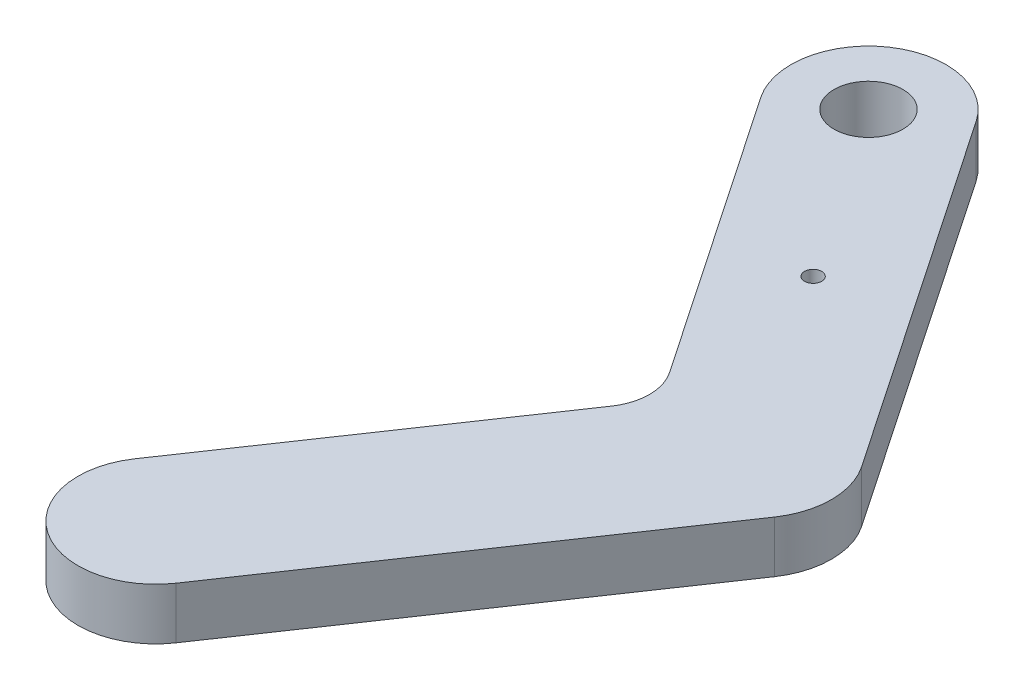
ISO-10303-21;
HEADER;
FILE_DESCRIPTION(('STEP AP214'),'2;1');
FILE_NAME('part.step','',(''),(''),'','','');
FILE_SCHEMA(('AUTOMOTIVE_DESIGN { 1 0 10303 214 1 1 1 1 }'));
ENDSEC;
DATA;
#1=APPLICATION_CONTEXT('core data for automotive mechanical design processes');
#2=APPLICATION_PROTOCOL_DEFINITION('international standard','automotive_design',2000,#1);
#3=PRODUCT_CONTEXT('',#1,'mechanical');
#4=PRODUCT('Part','Part','',(#3));
#5=PRODUCT_RELATED_PRODUCT_CATEGORY('part','',(#4));
#6=PRODUCT_DEFINITION_FORMATION('','',#4);
#7=PRODUCT_DEFINITION_CONTEXT('part definition',#1,'design');
#8=PRODUCT_DEFINITION('design','',#6,#7);
#9=PRODUCT_DEFINITION_SHAPE('','',#8);
#10=(LENGTH_UNIT() NAMED_UNIT(*) SI_UNIT(.MILLI.,.METRE.));
#11=(NAMED_UNIT(*) PLANE_ANGLE_UNIT() SI_UNIT($,.RADIAN.));
#12=(NAMED_UNIT(*) SI_UNIT($,.STERADIAN.) SOLID_ANGLE_UNIT());
#13=UNCERTAINTY_MEASURE_WITH_UNIT(LENGTH_MEASURE(1.E-05),#10,'distance_accuracy_value','');
#14=(GEOMETRIC_REPRESENTATION_CONTEXT(3) GLOBAL_UNCERTAINTY_ASSIGNED_CONTEXT((#13)) GLOBAL_UNIT_ASSIGNED_CONTEXT((#10,
#11,#12)) REPRESENTATION_CONTEXT('',''));
#15=CARTESIAN_POINT('',(0.,0.,0.));
#16=DIRECTION('',(0.,0.,1.));
#17=DIRECTION('',(1.,0.,0.));
#18=AXIS2_PLACEMENT_3D('',#15,#16,#17);
#19=CARTESIAN_POINT('',(5.09123981266612,3.,-21.9110063382461));
#20=DIRECTION('',(0.,-1.,0.));
#21=DIRECTION('',(0.,0.,-1.));
#22=AXIS2_PLACEMENT_3D('',#19,#20,#21);
#23=PLANE('',#22);
#24=CARTESIAN_POINT('',(5.09123981266612,3.,-21.9110063382461));
#25=DIRECTION('',(0.,1.,0.));
#26=DIRECTION('',(0.,0.,-1.));
#27=AXIS2_PLACEMENT_3D('',#24,#25,#26);
#28=CIRCLE('',#27,4.5);
#29=CARTESIAN_POINT('',(8.8147040536048,3.,-24.4380231657427));
#30=VERTEX_POINT('',#29);
#31=CARTESIAN_POINT('',(1.36777557172745,3.,-19.3839895107495));
#32=VERTEX_POINT('',#31);
#33=EDGE_CURVE('E145',#30,#32,#28,.T.);
#34=ORIENTED_EDGE('',*,*,#33,.T.);
#35=DIRECTION('',(0.561559294999244,0.,0.827436497986373));
#36=VECTOR('',#35,1.);
#37=CARTESIAN_POINT('',(1.36777557172745,3.,-19.3839895107495));
#38=LINE('',#37,#36);
#39=CARTESIAN_POINT('',(12.5483919944499,3.,-2.90977177358452));
#40=VERTEX_POINT('',#39);
#41=EDGE_CURVE('E93',#32,#40,#38,.T.);
#42=ORIENTED_EDGE('',*,*,#41,.T.);
#43=CARTESIAN_POINT('',(10.0660825004908,3.,-1.22509388858679));
#44=DIRECTION('',(0.,-1.,0.));
#45=DIRECTION('',(0.,0.,-1.));
#46=AXIS2_PLACEMENT_3D('',#43,#44,#45);
#47=CIRCLE('',#46,3.);
#48=CARTESIAN_POINT('',(12.5483919944499,3.,0.45958399641094));
#49=VERTEX_POINT('',#48);
#50=EDGE_CURVE('E160',#40,#49,#47,.T.);
#51=ORIENTED_EDGE('',*,*,#50,.T.);
#52=DIRECTION('',(-0.561559294999243,0.,0.827436497986373));
#53=VECTOR('',#52,1.);
#54=CARTESIAN_POINT('',(12.5483919944499,3.,0.45958399641094));
#55=LINE('',#54,#53);
#56=CARTESIAN_POINT('',(1.36777557172745,3.,16.933801733576));
#57=VERTEX_POINT('',#56);
#58=EDGE_CURVE('E173',#49,#57,#55,.T.);
#59=ORIENTED_EDGE('',*,*,#58,.T.);
#60=CARTESIAN_POINT('',(5.09123981266613,3.,19.4608185610725));
#61=DIRECTION('',(0.,1.,0.));
#62=DIRECTION('',(0.,0.,1.));
#63=AXIS2_PLACEMENT_3D('',#60,#61,#62);
#64=CIRCLE('',#63,4.5);
#65=CARTESIAN_POINT('',(8.8147040536048,3.,21.9878353885691));
#66=VERTEX_POINT('',#65);
#67=EDGE_CURVE('E112',#57,#66,#64,.T.);
#68=ORIENTED_EDGE('',*,*,#67,.T.);
#69=DIRECTION('',(0.561559294999243,0.,-0.827436497986373));
#70=VECTOR('',#69,1.);
#71=CARTESIAN_POINT('',(8.8147040536048,3.,21.9878353885691));
#72=LINE('',#71,#70);
#73=CARTESIAN_POINT('',(22.8536864285859,3.,1.30192293890981));
#74=VERTEX_POINT('',#73);
#75=EDGE_CURVE('E106',#66,#74,#72,.T.);
#76=ORIENTED_EDGE('',*,*,#75,.T.);
#77=CARTESIAN_POINT('',(19.1302221876472,3.,-1.22509388858679));
#78=DIRECTION('',(0.,1.,0.));
#79=DIRECTION('',(0.,0.,-1.));
#80=AXIS2_PLACEMENT_3D('',#77,#78,#79);
#81=CIRCLE('',#80,4.5);
#82=CARTESIAN_POINT('',(22.8536864285859,3.,-3.75211071608339));
#83=VERTEX_POINT('',#82);
#84=EDGE_CURVE('E110',#74,#83,#81,.T.);
#85=ORIENTED_EDGE('',*,*,#84,.T.);
#86=DIRECTION('',(-0.561559294999243,0.,-0.827436497986373));
#87=VECTOR('',#86,1.);
#88=CARTESIAN_POINT('',(8.8147040536048,3.,-24.4380231657427));
#89=LINE('',#88,#87);
#90=EDGE_CURVE('E50',#83,#30,#89,.T.);
#91=ORIENTED_EDGE('',*,*,#90,.T.);
#92=EDGE_LOOP('',(#34,#42,#51,#59,#68,#76,#85,#91));
#93=FACE_BOUND('',#92,.T.);
#94=CARTESIAN_POINT('',(11.8776838927319,3.,-11.9114362600808));
#95=DIRECTION('',(0.,1.,0.));
#96=DIRECTION('',(0.,0.,1.));
#97=AXIS2_PLACEMENT_3D('',#94,#95,#96);
#98=CIRCLE('',#97,0.500000000000001);
#99=CARTESIAN_POINT('',(11.8776838927319,3.,-11.4114362600808));
#100=VERTEX_POINT('',#99);
#101=EDGE_CURVE('E134',#100,#100,#98,.T.);
#102=ORIENTED_EDGE('',*,*,#101,.F.);
#103=EDGE_LOOP('',(#102));
#104=FACE_BOUND('',#103,.T.);
#105=CARTESIAN_POINT('',(5.09123981266612,3.,-21.9110063382461));
#106=DIRECTION('',(0.,1.,0.));
#107=DIRECTION('',(0.,0.,1.));
#108=AXIS2_PLACEMENT_3D('',#105,#106,#107);
#109=CIRCLE('',#108,2.);
#110=CARTESIAN_POINT('',(5.09123981266612,3.,-19.9110063382461));
#111=VERTEX_POINT('',#110);
#112=EDGE_CURVE('E182',#111,#111,#109,.T.);
#113=ORIENTED_EDGE('',*,*,#112,.F.);
#114=EDGE_LOOP('',(#113));
#115=FACE_BOUND('',#114,.T.);
#116=ADVANCED_FACE('F33',(#93,#104,#115),#23,.F.);
#117=CARTESIAN_POINT('',(5.09123981266612,0.,-21.9110063382461));
#118=DIRECTION('',(0.,-1.,0.));
#119=DIRECTION('',(0.,0.,-1.));
#120=AXIS2_PLACEMENT_3D('',#117,#118,#119);
#121=PLANE('',#120);
#122=CARTESIAN_POINT('',(11.8776838927319,0.,-11.9114362600808));
#123=DIRECTION('',(0.,1.,0.));
#124=DIRECTION('',(0.,0.,1.));
#125=AXIS2_PLACEMENT_3D('',#122,#123,#124);
#126=CIRCLE('',#125,0.500000000000001);
#127=CARTESIAN_POINT('',(11.8776838927319,0.,-11.4114362600808));
#128=VERTEX_POINT('',#127);
#129=EDGE_CURVE('E179',#128,#128,#126,.T.);
#130=ORIENTED_EDGE('',*,*,#129,.T.);
#131=EDGE_LOOP('',(#130));
#132=FACE_BOUND('',#131,.T.);
#133=CARTESIAN_POINT('',(5.09123981266612,0.,-21.9110063382461));
#134=DIRECTION('',(0.,1.,0.));
#135=DIRECTION('',(0.,0.,-1.));
#136=AXIS2_PLACEMENT_3D('',#133,#134,#135);
#137=CIRCLE('',#136,4.5);
#138=CARTESIAN_POINT('',(8.8147040536048,0.,-24.4380231657427));
#139=VERTEX_POINT('',#138);
#140=CARTESIAN_POINT('',(1.36777557172745,0.,-19.3839895107495));
#141=VERTEX_POINT('',#140);
#142=EDGE_CURVE('E130',#139,#141,#137,.T.);
#143=ORIENTED_EDGE('',*,*,#142,.F.);
#144=DIRECTION('',(-0.561559294999243,0.,-0.827436497986373));
#145=VECTOR('',#144,1.);
#146=CARTESIAN_POINT('',(8.8147040536048,0.,-24.4380231657427));
#147=LINE('',#146,#145);
#148=CARTESIAN_POINT('',(22.8536864285859,0.,-3.75211071608339));
#149=VERTEX_POINT('',#148);
#150=EDGE_CURVE('E85',#149,#139,#147,.T.);
#151=ORIENTED_EDGE('',*,*,#150,.F.);
#152=CARTESIAN_POINT('',(19.1302221876472,0.,-1.22509388858679));
#153=DIRECTION('',(0.,1.,0.));
#154=DIRECTION('',(0.,0.,-1.));
#155=AXIS2_PLACEMENT_3D('',#152,#153,#154);
#156=CIRCLE('',#155,4.5);
#157=CARTESIAN_POINT('',(22.8536864285859,0.,1.30192293890981));
#158=VERTEX_POINT('',#157);
#159=EDGE_CURVE('E79',#158,#149,#156,.T.);
#160=ORIENTED_EDGE('',*,*,#159,.F.);
#161=DIRECTION('',(0.561559294999243,0.,-0.827436497986373));
#162=VECTOR('',#161,1.);
#163=CARTESIAN_POINT('',(8.8147040536048,0.,21.9878353885691));
#164=LINE('',#163,#162);
#165=CARTESIAN_POINT('',(8.8147040536048,0.,21.9878353885691));
#166=VERTEX_POINT('',#165);
#167=EDGE_CURVE('E120',#166,#158,#164,.T.);
#168=ORIENTED_EDGE('',*,*,#167,.F.);
#169=CARTESIAN_POINT('',(5.09123981266613,0.,19.4608185610725));
#170=DIRECTION('',(0.,1.,0.));
#171=DIRECTION('',(0.,0.,1.));
#172=AXIS2_PLACEMENT_3D('',#169,#170,#171);
#173=CIRCLE('',#172,4.5);
#174=CARTESIAN_POINT('',(1.36777557172745,0.,16.933801733576));
#175=VERTEX_POINT('',#174);
#176=EDGE_CURVE('E140',#175,#166,#173,.T.);
#177=ORIENTED_EDGE('',*,*,#176,.F.);
#178=DIRECTION('',(-0.561559294999243,0.,0.827436497986373));
#179=VECTOR('',#178,1.);
#180=CARTESIAN_POINT('',(12.5483919944499,0.,0.45958399641094));
#181=LINE('',#180,#179);
#182=CARTESIAN_POINT('',(12.5483919944499,0.,0.45958399641094));
#183=VERTEX_POINT('',#182);
#184=EDGE_CURVE('E138',#183,#175,#181,.T.);
#185=ORIENTED_EDGE('',*,*,#184,.F.);
#186=CARTESIAN_POINT('',(10.0660825004908,0.,-1.22509388858679));
#187=DIRECTION('',(0.,-1.,0.));
#188=DIRECTION('',(0.,0.,-1.));
#189=AXIS2_PLACEMENT_3D('',#186,#187,#188);
#190=CIRCLE('',#189,3.);
#191=CARTESIAN_POINT('',(12.5483919944499,0.,-2.90977177358452));
#192=VERTEX_POINT('',#191);
#193=EDGE_CURVE('E136',#192,#183,#190,.T.);
#194=ORIENTED_EDGE('',*,*,#193,.F.);
#195=DIRECTION('',(0.561559294999244,0.,0.827436497986373));
#196=VECTOR('',#195,1.);
#197=CARTESIAN_POINT('',(1.36777557172745,0.,-19.3839895107495));
#198=LINE('',#197,#196);
#199=EDGE_CURVE('E133',#141,#192,#198,.T.);
#200=ORIENTED_EDGE('',*,*,#199,.F.);
#201=EDGE_LOOP('',(#143,#151,#160,#168,#177,#185,#194,#200));
#202=FACE_BOUND('',#201,.T.);
#203=CARTESIAN_POINT('',(5.09123981266612,0.,-21.9110063382461));
#204=DIRECTION('',(0.,1.,0.));
#205=DIRECTION('',(0.,0.,1.));
#206=AXIS2_PLACEMENT_3D('',#203,#204,#205);
#207=CIRCLE('',#206,2.);
#208=CARTESIAN_POINT('',(5.09123981266612,0.,-19.9110063382461));
#209=VERTEX_POINT('',#208);
#210=EDGE_CURVE('E185',#209,#209,#207,.T.);
#211=ORIENTED_EDGE('',*,*,#210,.T.);
#212=EDGE_LOOP('',(#211));
#213=FACE_BOUND('',#212,.T.);
#214=ADVANCED_FACE('F164',(#132,#202,#213),#121,.T.);
#215=CARTESIAN_POINT('',(5.09123981266612,3.,-21.9110063382461));
#216=DIRECTION('',(0.,-1.,0.));
#217=DIRECTION('',(0.,0.,-1.));
#218=AXIS2_PLACEMENT_3D('',#215,#216,#217);
#219=CYLINDRICAL_SURFACE('',#218,4.5);
#220=ORIENTED_EDGE('',*,*,#142,.T.);
#221=DIRECTION('',(0.,-1.,0.));
#222=VECTOR('',#221,1.);
#223=CARTESIAN_POINT('',(1.36777557172745,3.,-19.3839895107495));
#224=LINE('',#223,#222);
#225=EDGE_CURVE('E11',#32,#141,#224,.T.);
#226=ORIENTED_EDGE('',*,*,#225,.F.);
#227=ORIENTED_EDGE('',*,*,#33,.F.);
#228=DIRECTION('',(0.,-1.,0.));
#229=VECTOR('',#228,1.);
#230=CARTESIAN_POINT('',(8.8147040536048,3.,-24.4380231657427));
#231=LINE('',#230,#229);
#232=EDGE_CURVE('E126',#30,#139,#231,.T.);
#233=ORIENTED_EDGE('',*,*,#232,.T.);
#234=EDGE_LOOP('',(#220,#226,#227,#233));
#235=FACE_BOUND('',#234,.T.);
#236=ADVANCED_FACE('F35',(#235),#219,.T.);
#237=CARTESIAN_POINT('',(1.36777557172745,3.,-19.3839895107495));
#238=DIRECTION('',(0.827436497986373,0.,-0.561559294999244));
#239=DIRECTION('',(-0.561559294999244,0.,-0.827436497986373));
#240=AXIS2_PLACEMENT_3D('',#237,#238,#239);
#241=PLANE('',#240);
#242=ORIENTED_EDGE('',*,*,#199,.T.);
#243=DIRECTION('',(0.,-1.,0.));
#244=VECTOR('',#243,1.);
#245=CARTESIAN_POINT('',(12.5483919944499,3.,-2.90977177358452));
#246=LINE('',#245,#244);
#247=EDGE_CURVE('E42',#40,#192,#246,.T.);
#248=ORIENTED_EDGE('',*,*,#247,.F.);
#249=ORIENTED_EDGE('',*,*,#41,.F.);
#250=ORIENTED_EDGE('',*,*,#225,.T.);
#251=EDGE_LOOP('',(#242,#248,#249,#250));
#252=FACE_BOUND('',#251,.T.);
#253=ADVANCED_FACE('F217',(#252),#241,.F.);
#254=CARTESIAN_POINT('',(10.0660825004908,3.,-1.22509388858679));
#255=DIRECTION('',(0.,-1.,0.));
#256=DIRECTION('',(0.,0.,-1.));
#257=AXIS2_PLACEMENT_3D('',#254,#255,#256);
#258=CYLINDRICAL_SURFACE('',#257,3.);
#259=ORIENTED_EDGE('',*,*,#193,.T.);
#260=DIRECTION('',(0.,-1.,0.));
#261=VECTOR('',#260,1.);
#262=CARTESIAN_POINT('',(12.5483919944499,3.,0.45958399641094));
#263=LINE('',#262,#261);
#264=EDGE_CURVE('E152',#49,#183,#263,.T.);
#265=ORIENTED_EDGE('',*,*,#264,.F.);
#266=ORIENTED_EDGE('',*,*,#50,.F.);
#267=ORIENTED_EDGE('',*,*,#247,.T.);
#268=EDGE_LOOP('',(#259,#265,#266,#267));
#269=FACE_BOUND('',#268,.T.);
#270=ADVANCED_FACE('F158',(#269),#258,.F.);
#271=CARTESIAN_POINT('',(12.5483919944499,3.,0.45958399641094));
#272=DIRECTION('',(0.827436497986373,0.,0.561559294999243));
#273=DIRECTION('',(0.561559294999243,0.,-0.827436497986373));
#274=AXIS2_PLACEMENT_3D('',#271,#272,#273);
#275=PLANE('',#274);
#276=ORIENTED_EDGE('',*,*,#184,.T.);
#277=DIRECTION('',(0.,-1.,0.));
#278=VECTOR('',#277,1.);
#279=CARTESIAN_POINT('',(1.36777557172745,3.,16.933801733576));
#280=LINE('',#279,#278);
#281=EDGE_CURVE('E149',#57,#175,#280,.T.);
#282=ORIENTED_EDGE('',*,*,#281,.F.);
#283=ORIENTED_EDGE('',*,*,#58,.F.);
#284=ORIENTED_EDGE('',*,*,#264,.T.);
#285=EDGE_LOOP('',(#276,#282,#283,#284));
#286=FACE_BOUND('',#285,.T.);
#287=ADVANCED_FACE('F169',(#286),#275,.F.);
#288=CARTESIAN_POINT('',(5.09123981266613,3.,19.4608185610725));
#289=DIRECTION('',(0.,-1.,0.));
#290=DIRECTION('',(0.,0.,-1.));
#291=AXIS2_PLACEMENT_3D('',#288,#289,#290);
#292=CYLINDRICAL_SURFACE('',#291,4.5);
#293=ORIENTED_EDGE('',*,*,#176,.T.);
#294=DIRECTION('',(0.,-1.,0.));
#295=VECTOR('',#294,1.);
#296=CARTESIAN_POINT('',(8.8147040536048,3.,21.9878353885691));
#297=LINE('',#296,#295);
#298=EDGE_CURVE('E121',#66,#166,#297,.T.);
#299=ORIENTED_EDGE('',*,*,#298,.F.);
#300=ORIENTED_EDGE('',*,*,#67,.F.);
#301=ORIENTED_EDGE('',*,*,#281,.T.);
#302=EDGE_LOOP('',(#293,#299,#300,#301));
#303=FACE_BOUND('',#302,.T.);
#304=ADVANCED_FACE('F172',(#303),#292,.T.);
#305=CARTESIAN_POINT('',(8.8147040536048,3.,21.9878353885691));
#306=DIRECTION('',(-0.827436497986373,0.,-0.561559294999243));
#307=DIRECTION('',(-0.561559294999243,0.,0.827436497986373));
#308=AXIS2_PLACEMENT_3D('',#305,#306,#307);
#309=PLANE('',#308);
#310=ORIENTED_EDGE('',*,*,#167,.T.);
#311=DIRECTION('',(0.,-1.,0.));
#312=VECTOR('',#311,1.);
#313=CARTESIAN_POINT('',(22.8536864285859,3.,1.30192293890981));
#314=LINE('',#313,#312);
#315=EDGE_CURVE('E117',#74,#158,#314,.T.);
#316=ORIENTED_EDGE('',*,*,#315,.F.);
#317=ORIENTED_EDGE('',*,*,#75,.F.);
#318=ORIENTED_EDGE('',*,*,#298,.T.);
#319=EDGE_LOOP('',(#310,#316,#317,#318));
#320=FACE_BOUND('',#319,.T.);
#321=ADVANCED_FACE('F118',(#320),#309,.F.);
#322=CARTESIAN_POINT('',(19.1302221876472,3.,-1.22509388858679));
#323=DIRECTION('',(0.,-1.,0.));
#324=DIRECTION('',(0.,0.,-1.));
#325=AXIS2_PLACEMENT_3D('',#322,#323,#324);
#326=CYLINDRICAL_SURFACE('',#325,4.5);
#327=ORIENTED_EDGE('',*,*,#159,.T.);
#328=DIRECTION('',(0.,-1.,0.));
#329=VECTOR('',#328,1.);
#330=CARTESIAN_POINT('',(22.8536864285859,3.,-3.75211071608339));
#331=LINE('',#330,#329);
#332=EDGE_CURVE('E122',#83,#149,#331,.T.);
#333=ORIENTED_EDGE('',*,*,#332,.F.);
#334=ORIENTED_EDGE('',*,*,#84,.F.);
#335=ORIENTED_EDGE('',*,*,#315,.T.);
#336=EDGE_LOOP('',(#327,#333,#334,#335));
#337=FACE_BOUND('',#336,.T.);
#338=ADVANCED_FACE('F124',(#337),#326,.T.);
#339=CARTESIAN_POINT('',(8.8147040536048,3.,-24.4380231657427));
#340=DIRECTION('',(-0.827436497986373,0.,0.561559294999243));
#341=DIRECTION('',(0.561559294999243,0.,0.827436497986373));
#342=AXIS2_PLACEMENT_3D('',#339,#340,#341);
#343=PLANE('',#342);
#344=ORIENTED_EDGE('',*,*,#150,.T.);
#345=ORIENTED_EDGE('',*,*,#232,.F.);
#346=ORIENTED_EDGE('',*,*,#90,.F.);
#347=ORIENTED_EDGE('',*,*,#332,.T.);
#348=EDGE_LOOP('',(#344,#345,#346,#347));
#349=FACE_BOUND('',#348,.T.);
#350=ADVANCED_FACE('F205',(#349),#343,.F.);
#351=CARTESIAN_POINT('',(11.8776838927319,3.,-11.9114362600808));
#352=DIRECTION('',(0.,-1.,0.));
#353=DIRECTION('',(0.,0.,-1.));
#354=AXIS2_PLACEMENT_3D('',#351,#352,#353);
#355=CYLINDRICAL_SURFACE('',#354,0.500000000000001);
#356=ORIENTED_EDGE('',*,*,#101,.T.);
#357=EDGE_LOOP('',(#356));
#358=FACE_BOUND('',#357,.T.);
#359=ORIENTED_EDGE('',*,*,#129,.F.);
#360=EDGE_LOOP('',(#359));
#361=FACE_BOUND('',#360,.T.);
#362=ADVANCED_FACE('F202',(#358,#361),#355,.F.);
#363=CARTESIAN_POINT('',(5.09123981266612,3.,-21.9110063382461));
#364=DIRECTION('',(0.,-1.,0.));
#365=DIRECTION('',(0.,0.,-1.));
#366=AXIS2_PLACEMENT_3D('',#363,#364,#365);
#367=CYLINDRICAL_SURFACE('',#366,2.);
#368=ORIENTED_EDGE('',*,*,#112,.T.);
#369=EDGE_LOOP('',(#368));
#370=FACE_BOUND('',#369,.T.);
#371=ORIENTED_EDGE('',*,*,#210,.F.);
#372=EDGE_LOOP('',(#371));
#373=FACE_BOUND('',#372,.T.);
#374=ADVANCED_FACE('F191',(#370,#373),#367,.F.);
#375=CLOSED_SHELL('',(#116,#214,#236,#253,#270,#287,#304,#321,#338,#350,#362,#374));
#376=MANIFOLD_SOLID_BREP('B2',#375);
#377=ADVANCED_BREP_SHAPE_REPRESENTATION('',(#18,#376),#14);
#378=SHAPE_DEFINITION_REPRESENTATION(#9,#377);
ENDSEC;
END-ISO-10303-21;
